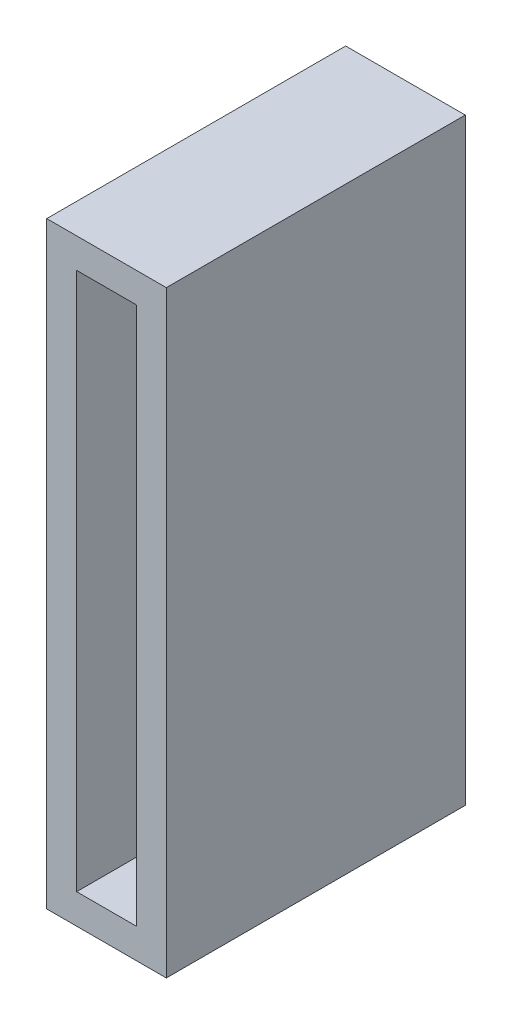
ISO-10303-21;
HEADER;
FILE_DESCRIPTION(('STEP AP214'),'2;1');
FILE_NAME('part.step','',(''),(''),'','','');
FILE_SCHEMA(('AUTOMOTIVE_DESIGN { 1 0 10303 214 1 1 1 1 }'));
ENDSEC;
DATA;
#1=APPLICATION_CONTEXT('core data for automotive mechanical design processes');
#2=APPLICATION_PROTOCOL_DEFINITION('international standard','automotive_design',2000,#1);
#3=PRODUCT_CONTEXT('',#1,'mechanical');
#4=PRODUCT('Part','Part','',(#3));
#5=PRODUCT_RELATED_PRODUCT_CATEGORY('part','',(#4));
#6=PRODUCT_DEFINITION_FORMATION('','',#4);
#7=PRODUCT_DEFINITION_CONTEXT('part definition',#1,'design');
#8=PRODUCT_DEFINITION('design','',#6,#7);
#9=PRODUCT_DEFINITION_SHAPE('','',#8);
#10=(LENGTH_UNIT() NAMED_UNIT(*) SI_UNIT(.MILLI.,.METRE.));
#11=(NAMED_UNIT(*) PLANE_ANGLE_UNIT() SI_UNIT($,.RADIAN.));
#12=(NAMED_UNIT(*) SI_UNIT($,.STERADIAN.) SOLID_ANGLE_UNIT());
#13=UNCERTAINTY_MEASURE_WITH_UNIT(LENGTH_MEASURE(1.E-05),#10,'distance_accuracy_value','');
#14=(GEOMETRIC_REPRESENTATION_CONTEXT(3) GLOBAL_UNCERTAINTY_ASSIGNED_CONTEXT((#13)) GLOBAL_UNIT_ASSIGNED_CONTEXT((#10,
#11,#12)) REPRESENTATION_CONTEXT('',''));
#15=CARTESIAN_POINT('',(0.,0.,0.));
#16=DIRECTION('',(0.,0.,1.));
#17=DIRECTION('',(1.,0.,0.));
#18=AXIS2_PLACEMENT_3D('',#15,#16,#17);
#19=CARTESIAN_POINT('',(0.,0.,100.));
#20=DIRECTION('',(0.,0.,-1.));
#21=DIRECTION('',(-1.,0.,0.));
#22=AXIS2_PLACEMENT_3D('',#19,#20,#21);
#23=PLANE('',#22);
#24=DIRECTION('',(1.,0.,0.));
#25=VECTOR('',#24,1.);
#26=CARTESIAN_POINT('',(0.,200.,100.));
#27=LINE('',#26,#25);
#28=CARTESIAN_POINT('',(0.,200.,100.));
#29=VERTEX_POINT('',#28);
#30=CARTESIAN_POINT('',(40.,200.,100.));
#31=VERTEX_POINT('',#30);
#32=EDGE_CURVE('E161',#29,#31,#27,.T.);
#33=ORIENTED_EDGE('',*,*,#32,.F.);
#34=DIRECTION('',(0.,-1.,0.));
#35=VECTOR('',#34,1.);
#36=CARTESIAN_POINT('',(0.,200.,100.));
#37=LINE('',#36,#35);
#38=CARTESIAN_POINT('',(0.,0.,100.));
#39=VERTEX_POINT('',#38);
#40=EDGE_CURVE('E171',#29,#39,#37,.T.);
#41=ORIENTED_EDGE('',*,*,#40,.T.);
#42=DIRECTION('',(-1.,0.,0.));
#43=VECTOR('',#42,1.);
#44=CARTESIAN_POINT('',(40.,0.,100.));
#45=LINE('',#44,#43);
#46=CARTESIAN_POINT('',(40.,0.,100.));
#47=VERTEX_POINT('',#46);
#48=EDGE_CURVE('E168',#47,#39,#45,.T.);
#49=ORIENTED_EDGE('',*,*,#48,.F.);
#50=DIRECTION('',(0.,-1.,0.));
#51=VECTOR('',#50,1.);
#52=CARTESIAN_POINT('',(40.,200.,100.));
#53=LINE('',#52,#51);
#54=EDGE_CURVE('E164',#31,#47,#53,.T.);
#55=ORIENTED_EDGE('',*,*,#54,.F.);
#56=EDGE_LOOP('',(#33,#41,#49,#55));
#57=FACE_BOUND('',#56,.T.);
#58=DIRECTION('',(-1.,0.,0.));
#59=VECTOR('',#58,1.);
#60=CARTESIAN_POINT('',(30.,190.,100.));
#61=LINE('',#60,#59);
#62=CARTESIAN_POINT('',(30.,190.,100.));
#63=VERTEX_POINT('',#62);
#64=CARTESIAN_POINT('',(9.99999999999999,190.,100.));
#65=VERTEX_POINT('',#64);
#66=EDGE_CURVE('E125',#63,#65,#61,.T.);
#67=ORIENTED_EDGE('',*,*,#66,.F.);
#68=DIRECTION('',(0.,1.,0.));
#69=VECTOR('',#68,1.);
#70=CARTESIAN_POINT('',(30.,10.,100.));
#71=LINE('',#70,#69);
#72=CARTESIAN_POINT('',(30.,10.,100.));
#73=VERTEX_POINT('',#72);
#74=EDGE_CURVE('E147',#73,#63,#71,.T.);
#75=ORIENTED_EDGE('',*,*,#74,.F.);
#76=DIRECTION('',(1.,0.,0.));
#77=VECTOR('',#76,1.);
#78=CARTESIAN_POINT('',(10.,9.99999999999999,100.));
#79=LINE('',#78,#77);
#80=CARTESIAN_POINT('',(10.,9.99999999999999,100.));
#81=VERTEX_POINT('',#80);
#82=EDGE_CURVE('E145',#81,#73,#79,.T.);
#83=ORIENTED_EDGE('',*,*,#82,.F.);
#84=DIRECTION('',(0.,-1.,0.));
#85=VECTOR('',#84,1.);
#86=CARTESIAN_POINT('',(9.99999999999999,190.,100.));
#87=LINE('',#86,#85);
#88=EDGE_CURVE('E133',#65,#81,#87,.T.);
#89=ORIENTED_EDGE('',*,*,#88,.F.);
#90=EDGE_LOOP('',(#67,#75,#83,#89));
#91=FACE_BOUND('',#90,.T.);
#92=ADVANCED_FACE('F59',(#57,#91),#23,.F.);
#93=CARTESIAN_POINT('',(0.,0.,0.));
#94=DIRECTION('',(0.,0.,-1.));
#95=DIRECTION('',(-1.,0.,0.));
#96=AXIS2_PLACEMENT_3D('',#93,#94,#95);
#97=PLANE('',#96);
#98=DIRECTION('',(1.,0.,0.));
#99=VECTOR('',#98,1.);
#100=CARTESIAN_POINT('',(0.,200.,0.));
#101=LINE('',#100,#99);
#102=CARTESIAN_POINT('',(0.,200.,0.));
#103=VERTEX_POINT('',#102);
#104=CARTESIAN_POINT('',(40.,200.,0.));
#105=VERTEX_POINT('',#104);
#106=EDGE_CURVE('E141',#103,#105,#101,.T.);
#107=ORIENTED_EDGE('',*,*,#106,.T.);
#108=DIRECTION('',(0.,-1.,0.));
#109=VECTOR('',#108,1.);
#110=CARTESIAN_POINT('',(40.,200.,0.));
#111=LINE('',#110,#109);
#112=CARTESIAN_POINT('',(40.,0.,0.));
#113=VERTEX_POINT('',#112);
#114=EDGE_CURVE('E175',#105,#113,#111,.T.);
#115=ORIENTED_EDGE('',*,*,#114,.T.);
#116=DIRECTION('',(-1.,0.,0.));
#117=VECTOR('',#116,1.);
#118=CARTESIAN_POINT('',(40.,0.,0.));
#119=LINE('',#118,#117);
#120=CARTESIAN_POINT('',(0.,0.,0.));
#121=VERTEX_POINT('',#120);
#122=EDGE_CURVE('E178',#113,#121,#119,.T.);
#123=ORIENTED_EDGE('',*,*,#122,.T.);
#124=DIRECTION('',(0.,-1.,0.));
#125=VECTOR('',#124,1.);
#126=CARTESIAN_POINT('',(0.,200.,0.));
#127=LINE('',#126,#125);
#128=EDGE_CURVE('E165',#103,#121,#127,.T.);
#129=ORIENTED_EDGE('',*,*,#128,.F.);
#130=EDGE_LOOP('',(#107,#115,#123,#129));
#131=FACE_BOUND('',#130,.T.);
#132=DIRECTION('',(0.,1.,0.));
#133=VECTOR('',#132,1.);
#134=CARTESIAN_POINT('',(30.,10.,0.));
#135=LINE('',#134,#133);
#136=CARTESIAN_POINT('',(30.,10.,0.));
#137=VERTEX_POINT('',#136);
#138=CARTESIAN_POINT('',(30.,190.,0.));
#139=VERTEX_POINT('',#138);
#140=EDGE_CURVE('E134',#137,#139,#135,.T.);
#141=ORIENTED_EDGE('',*,*,#140,.T.);
#142=DIRECTION('',(-1.,0.,0.));
#143=VECTOR('',#142,1.);
#144=CARTESIAN_POINT('',(30.,190.,0.));
#145=LINE('',#144,#143);
#146=CARTESIAN_POINT('',(9.99999999999999,190.,0.));
#147=VERTEX_POINT('',#146);
#148=EDGE_CURVE('E84',#139,#147,#145,.T.);
#149=ORIENTED_EDGE('',*,*,#148,.T.);
#150=DIRECTION('',(0.,-1.,0.));
#151=VECTOR('',#150,1.);
#152=CARTESIAN_POINT('',(9.99999999999999,190.,0.));
#153=LINE('',#152,#151);
#154=CARTESIAN_POINT('',(10.,9.99999999999999,0.));
#155=VERTEX_POINT('',#154);
#156=EDGE_CURVE('E140',#147,#155,#153,.T.);
#157=ORIENTED_EDGE('',*,*,#156,.T.);
#158=DIRECTION('',(1.,0.,0.));
#159=VECTOR('',#158,1.);
#160=CARTESIAN_POINT('',(10.,9.99999999999999,0.));
#161=LINE('',#160,#159);
#162=EDGE_CURVE('E153',#155,#137,#161,.T.);
#163=ORIENTED_EDGE('',*,*,#162,.T.);
#164=EDGE_LOOP('',(#141,#149,#157,#163));
#165=FACE_BOUND('',#164,.T.);
#166=ADVANCED_FACE('F194',(#131,#165),#97,.T.);
#167=CARTESIAN_POINT('',(0.,200.,100.));
#168=DIRECTION('',(0.,1.,0.));
#169=DIRECTION('',(0.,0.,1.));
#170=AXIS2_PLACEMENT_3D('',#167,#168,#169);
#171=PLANE('',#170);
#172=ORIENTED_EDGE('',*,*,#106,.F.);
#173=DIRECTION('',(0.,0.,-1.));
#174=VECTOR('',#173,1.);
#175=CARTESIAN_POINT('',(0.,200.,100.));
#176=LINE('',#175,#174);
#177=EDGE_CURVE('E12',#29,#103,#176,.T.);
#178=ORIENTED_EDGE('',*,*,#177,.F.);
#179=ORIENTED_EDGE('',*,*,#32,.T.);
#180=DIRECTION('',(0.,0.,-1.));
#181=VECTOR('',#180,1.);
#182=CARTESIAN_POINT('',(40.,200.,100.));
#183=LINE('',#182,#181);
#184=EDGE_CURVE('E63',#31,#105,#183,.T.);
#185=ORIENTED_EDGE('',*,*,#184,.T.);
#186=EDGE_LOOP('',(#172,#178,#179,#185));
#187=FACE_BOUND('',#186,.T.);
#188=ADVANCED_FACE('F61',(#187),#171,.T.);
#189=CARTESIAN_POINT('',(0.,200.,100.));
#190=DIRECTION('',(1.,0.,0.));
#191=DIRECTION('',(0.,1.,0.));
#192=AXIS2_PLACEMENT_3D('',#189,#190,#191);
#193=PLANE('',#192);
#194=ORIENTED_EDGE('',*,*,#128,.T.);
#195=DIRECTION('',(0.,0.,-1.));
#196=VECTOR('',#195,1.);
#197=CARTESIAN_POINT('',(0.,0.,100.));
#198=LINE('',#197,#196);
#199=EDGE_CURVE('E68',#39,#121,#198,.T.);
#200=ORIENTED_EDGE('',*,*,#199,.F.);
#201=ORIENTED_EDGE('',*,*,#40,.F.);
#202=ORIENTED_EDGE('',*,*,#177,.T.);
#203=EDGE_LOOP('',(#194,#200,#201,#202));
#204=FACE_BOUND('',#203,.T.);
#205=ADVANCED_FACE('F198',(#204),#193,.F.);
#206=CARTESIAN_POINT('',(40.,0.,100.));
#207=DIRECTION('',(0.,-1.,0.));
#208=DIRECTION('',(1.,0.,0.));
#209=AXIS2_PLACEMENT_3D('',#206,#207,#208);
#210=PLANE('',#209);
#211=ORIENTED_EDGE('',*,*,#122,.F.);
#212=DIRECTION('',(0.,0.,-1.));
#213=VECTOR('',#212,1.);
#214=CARTESIAN_POINT('',(40.,0.,100.));
#215=LINE('',#214,#213);
#216=EDGE_CURVE('E183',#47,#113,#215,.T.);
#217=ORIENTED_EDGE('',*,*,#216,.F.);
#218=ORIENTED_EDGE('',*,*,#48,.T.);
#219=ORIENTED_EDGE('',*,*,#199,.T.);
#220=EDGE_LOOP('',(#211,#217,#218,#219));
#221=FACE_BOUND('',#220,.T.);
#222=ADVANCED_FACE('F203',(#221),#210,.T.);
#223=CARTESIAN_POINT('',(40.,200.,100.));
#224=DIRECTION('',(1.,0.,0.));
#225=DIRECTION('',(0.,1.,0.));
#226=AXIS2_PLACEMENT_3D('',#223,#224,#225);
#227=PLANE('',#226);
#228=ORIENTED_EDGE('',*,*,#114,.F.);
#229=ORIENTED_EDGE('',*,*,#184,.F.);
#230=ORIENTED_EDGE('',*,*,#54,.T.);
#231=ORIENTED_EDGE('',*,*,#216,.T.);
#232=EDGE_LOOP('',(#228,#229,#230,#231));
#233=FACE_BOUND('',#232,.T.);
#234=ADVANCED_FACE('F191',(#233),#227,.T.);
#235=CARTESIAN_POINT('',(30.,190.,100.));
#236=DIRECTION('',(0.,-1.,0.));
#237=DIRECTION('',(0.,0.,-1.));
#238=AXIS2_PLACEMENT_3D('',#235,#236,#237);
#239=PLANE('',#238);
#240=ORIENTED_EDGE('',*,*,#148,.F.);
#241=DIRECTION('',(0.,0.,-1.));
#242=VECTOR('',#241,1.);
#243=CARTESIAN_POINT('',(30.,190.,100.));
#244=LINE('',#243,#242);
#245=EDGE_CURVE('E129',#63,#139,#244,.T.);
#246=ORIENTED_EDGE('',*,*,#245,.F.);
#247=ORIENTED_EDGE('',*,*,#66,.T.);
#248=DIRECTION('',(0.,0.,-1.));
#249=VECTOR('',#248,1.);
#250=CARTESIAN_POINT('',(9.99999999999999,190.,100.));
#251=LINE('',#250,#249);
#252=EDGE_CURVE('E128',#65,#147,#251,.T.);
#253=ORIENTED_EDGE('',*,*,#252,.T.);
#254=EDGE_LOOP('',(#240,#246,#247,#253));
#255=FACE_BOUND('',#254,.T.);
#256=ADVANCED_FACE('F127',(#255),#239,.T.);
#257=CARTESIAN_POINT('',(9.99999999999999,190.,100.));
#258=DIRECTION('',(1.,0.,0.));
#259=DIRECTION('',(0.,1.,0.));
#260=AXIS2_PLACEMENT_3D('',#257,#258,#259);
#261=PLANE('',#260);
#262=ORIENTED_EDGE('',*,*,#156,.F.);
#263=ORIENTED_EDGE('',*,*,#252,.F.);
#264=ORIENTED_EDGE('',*,*,#88,.T.);
#265=DIRECTION('',(0.,0.,-1.));
#266=VECTOR('',#265,1.);
#267=CARTESIAN_POINT('',(10.,9.99999999999999,100.));
#268=LINE('',#267,#266);
#269=EDGE_CURVE('E142',#81,#155,#268,.T.);
#270=ORIENTED_EDGE('',*,*,#269,.T.);
#271=EDGE_LOOP('',(#262,#263,#264,#270));
#272=FACE_BOUND('',#271,.T.);
#273=ADVANCED_FACE('F137',(#272),#261,.T.);
#274=CARTESIAN_POINT('',(10.,9.99999999999999,100.));
#275=DIRECTION('',(0.,1.,0.));
#276=DIRECTION('',(-1.,0.,0.));
#277=AXIS2_PLACEMENT_3D('',#274,#275,#276);
#278=PLANE('',#277);
#279=ORIENTED_EDGE('',*,*,#162,.F.);
#280=ORIENTED_EDGE('',*,*,#269,.F.);
#281=ORIENTED_EDGE('',*,*,#82,.T.);
#282=DIRECTION('',(0.,0.,-1.));
#283=VECTOR('',#282,1.);
#284=CARTESIAN_POINT('',(30.,10.,100.));
#285=LINE('',#284,#283);
#286=EDGE_CURVE('E76',#73,#137,#285,.T.);
#287=ORIENTED_EDGE('',*,*,#286,.T.);
#288=EDGE_LOOP('',(#279,#280,#281,#287));
#289=FACE_BOUND('',#288,.T.);
#290=ADVANCED_FACE('F222',(#289),#278,.T.);
#291=CARTESIAN_POINT('',(30.,10.,100.));
#292=DIRECTION('',(-1.,0.,0.));
#293=DIRECTION('',(0.,0.,1.));
#294=AXIS2_PLACEMENT_3D('',#291,#292,#293);
#295=PLANE('',#294);
#296=ORIENTED_EDGE('',*,*,#140,.F.);
#297=ORIENTED_EDGE('',*,*,#286,.F.);
#298=ORIENTED_EDGE('',*,*,#74,.T.);
#299=ORIENTED_EDGE('',*,*,#245,.T.);
#300=EDGE_LOOP('',(#296,#297,#298,#299));
#301=FACE_BOUND('',#300,.T.);
#302=ADVANCED_FACE('F225',(#301),#295,.T.);
#303=CLOSED_SHELL('',(#92,#166,#188,#205,#222,#234,#256,#273,#290,#302));
#304=MANIFOLD_SOLID_BREP('B2',#303);
#305=ADVANCED_BREP_SHAPE_REPRESENTATION('',(#18,#304),#14);
#306=SHAPE_DEFINITION_REPRESENTATION(#9,#305);
ENDSEC;
END-ISO-10303-21;
